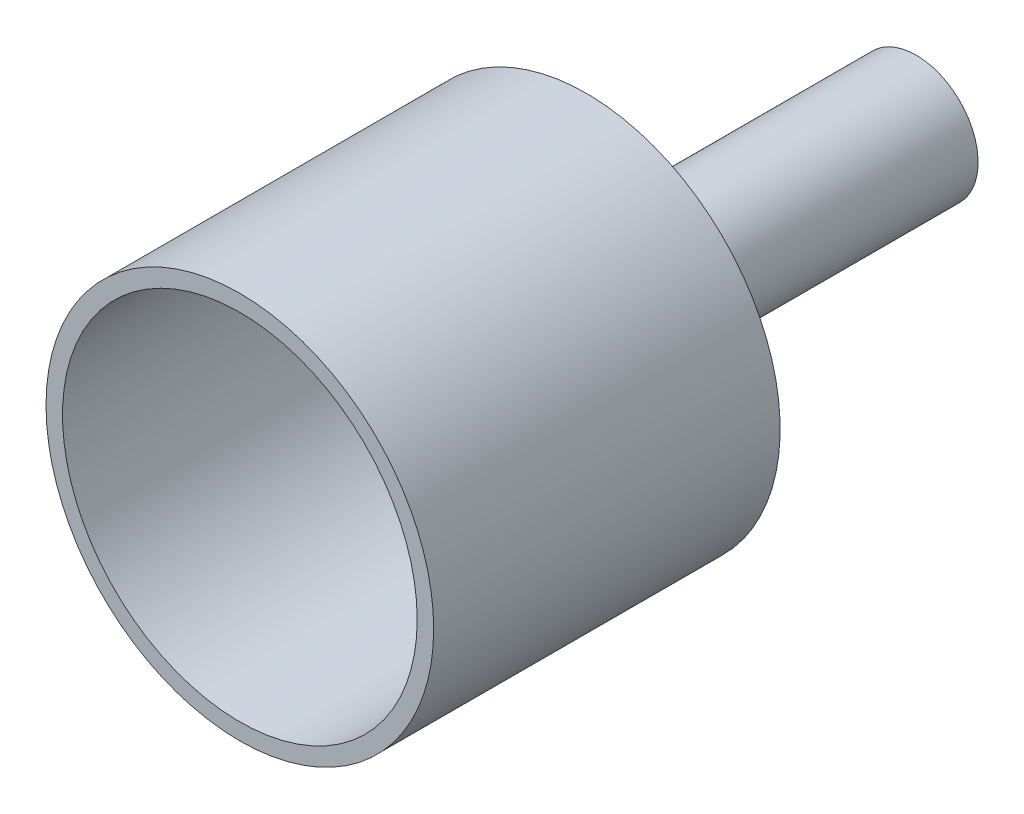
ISO-10303-21;
HEADER;
FILE_DESCRIPTION(('STEP AP214'),'2;1');
FILE_NAME('part.step','',(''),(''),'','','');
FILE_SCHEMA(('AUTOMOTIVE_DESIGN { 1 0 10303 214 1 1 1 1 }'));
ENDSEC;
DATA;
#1=APPLICATION_CONTEXT('core data for automotive mechanical design processes');
#2=APPLICATION_PROTOCOL_DEFINITION('international standard','automotive_design',2000,#1);
#3=PRODUCT_CONTEXT('',#1,'mechanical');
#4=PRODUCT('Part','Part','',(#3));
#5=PRODUCT_RELATED_PRODUCT_CATEGORY('part','',(#4));
#6=PRODUCT_DEFINITION_FORMATION('','',#4);
#7=PRODUCT_DEFINITION_CONTEXT('part definition',#1,'design');
#8=PRODUCT_DEFINITION('design','',#6,#7);
#9=PRODUCT_DEFINITION_SHAPE('','',#8);
#10=(LENGTH_UNIT() NAMED_UNIT(*) SI_UNIT(.MILLI.,.METRE.));
#11=(NAMED_UNIT(*) PLANE_ANGLE_UNIT() SI_UNIT($,.RADIAN.));
#12=(NAMED_UNIT(*) SI_UNIT($,.STERADIAN.) SOLID_ANGLE_UNIT());
#13=UNCERTAINTY_MEASURE_WITH_UNIT(LENGTH_MEASURE(1.E-05),#10,'distance_accuracy_value','');
#14=(GEOMETRIC_REPRESENTATION_CONTEXT(3) GLOBAL_UNCERTAINTY_ASSIGNED_CONTEXT((#13)) GLOBAL_UNIT_ASSIGNED_CONTEXT((#10,
#11,#12)) REPRESENTATION_CONTEXT('',''));
#15=CARTESIAN_POINT('',(0.,0.,0.));
#16=DIRECTION('',(0.,0.,1.));
#17=DIRECTION('',(1.,0.,0.));
#18=AXIS2_PLACEMENT_3D('',#15,#16,#17);
#19=CARTESIAN_POINT('',(0.,0.,40.));
#20=DIRECTION('',(0.,0.,1.));
#21=DIRECTION('',(1.,0.,0.));
#22=AXIS2_PLACEMENT_3D('',#19,#20,#21);
#23=PLANE('',#22);
#24=CARTESIAN_POINT('',(0.,0.,40.));
#25=DIRECTION('',(0.,0.,1.));
#26=DIRECTION('',(1.,0.,0.));
#27=AXIS2_PLACEMENT_3D('',#24,#25,#26);
#28=CIRCLE('',#27,23.5);
#29=CARTESIAN_POINT('',(23.5,0.,40.));
#30=VERTEX_POINT('',#29);
#31=EDGE_CURVE('E10',#30,#30,#28,.T.);
#32=ORIENTED_EDGE('',*,*,#31,.T.);
#33=EDGE_LOOP('',(#32));
#34=FACE_BOUND('',#33,.T.);
#35=CARTESIAN_POINT('',(0.,0.,40.));
#36=DIRECTION('',(0.,0.,1.));
#37=DIRECTION('',(1.,0.,0.));
#38=AXIS2_PLACEMENT_3D('',#35,#36,#37);
#39=CIRCLE('',#38,21.5);
#40=CARTESIAN_POINT('',(21.5,0.,40.));
#41=VERTEX_POINT('',#40);
#42=EDGE_CURVE('E45',#41,#41,#39,.T.);
#43=ORIENTED_EDGE('',*,*,#42,.F.);
#44=EDGE_LOOP('',(#43));
#45=FACE_BOUND('',#44,.T.);
#46=ADVANCED_FACE('F37',(#34,#45),#23,.T.);
#47=CARTESIAN_POINT('',(0.,0.,40.));
#48=DIRECTION('',(0.,0.,-1.));
#49=DIRECTION('',(-1.,0.,0.));
#50=AXIS2_PLACEMENT_3D('',#47,#48,#49);
#51=CYLINDRICAL_SURFACE('',#50,23.5);
#52=ORIENTED_EDGE('',*,*,#31,.F.);
#53=EDGE_LOOP('',(#52));
#54=FACE_BOUND('',#53,.T.);
#55=CARTESIAN_POINT('',(0.,0.,-2.));
#56=DIRECTION('',(0.,0.,-1.));
#57=DIRECTION('',(-1.,0.,0.));
#58=AXIS2_PLACEMENT_3D('',#55,#56,#57);
#59=CIRCLE('',#58,23.5);
#60=CARTESIAN_POINT('',(-23.5,0.,-2.));
#61=VERTEX_POINT('',#60);
#62=EDGE_CURVE('E56',#61,#61,#59,.T.);
#63=ORIENTED_EDGE('',*,*,#62,.F.);
#64=EDGE_LOOP('',(#63));
#65=FACE_BOUND('',#64,.T.);
#66=ADVANCED_FACE('F39',(#54,#65),#51,.T.);
#67=CARTESIAN_POINT('',(0.,0.,40.));
#68=DIRECTION('',(0.,0.,-1.));
#69=DIRECTION('',(-1.,0.,0.));
#70=AXIS2_PLACEMENT_3D('',#67,#68,#69);
#71=CYLINDRICAL_SURFACE('',#70,21.5);
#72=ORIENTED_EDGE('',*,*,#42,.T.);
#73=EDGE_LOOP('',(#72));
#74=FACE_BOUND('',#73,.T.);
#75=CARTESIAN_POINT('',(0.,0.,0.));
#76=DIRECTION('',(0.,0.,1.));
#77=DIRECTION('',(1.,0.,0.));
#78=AXIS2_PLACEMENT_3D('',#75,#76,#77);
#79=CIRCLE('',#78,21.5);
#80=CARTESIAN_POINT('',(21.5,0.,0.));
#81=VERTEX_POINT('',#80);
#82=EDGE_CURVE('E50',#81,#81,#79,.T.);
#83=ORIENTED_EDGE('',*,*,#82,.F.);
#84=EDGE_LOOP('',(#83));
#85=FACE_BOUND('',#84,.T.);
#86=ADVANCED_FACE('F97',(#74,#85),#71,.F.);
#87=CARTESIAN_POINT('',(0.,0.,0.));
#88=DIRECTION('',(0.,0.,-1.));
#89=DIRECTION('',(-1.,0.,0.));
#90=AXIS2_PLACEMENT_3D('',#87,#88,#89);
#91=PLANE('',#90);
#92=CARTESIAN_POINT('',(0.,0.,0.));
#93=DIRECTION('',(0.,0.,-1.));
#94=DIRECTION('',(-1.,0.,0.));
#95=AXIS2_PLACEMENT_3D('',#92,#93,#94);
#96=CIRCLE('',#95,5.5);
#97=CARTESIAN_POINT('',(-5.5,0.,0.));
#98=VERTEX_POINT('',#97);
#99=EDGE_CURVE('E73',#98,#98,#96,.T.);
#100=ORIENTED_EDGE('',*,*,#99,.T.);
#101=EDGE_LOOP('',(#100));
#102=FACE_BOUND('',#101,.T.);
#103=ORIENTED_EDGE('',*,*,#82,.T.);
#104=EDGE_LOOP('',(#103));
#105=FACE_BOUND('',#104,.T.);
#106=ADVANCED_FACE('F78',(#102,#105),#91,.F.);
#107=CARTESIAN_POINT('',(0.,0.,-2.));
#108=DIRECTION('',(0.,0.,-1.));
#109=DIRECTION('',(-1.,0.,0.));
#110=AXIS2_PLACEMENT_3D('',#107,#108,#109);
#111=PLANE('',#110);
#112=CARTESIAN_POINT('',(0.,0.,-2.));
#113=DIRECTION('',(0.,0.,-1.));
#114=DIRECTION('',(-1.,0.,0.));
#115=AXIS2_PLACEMENT_3D('',#112,#113,#114);
#116=CIRCLE('',#115,7.5);
#117=CARTESIAN_POINT('',(-7.5,0.,-2.));
#118=VERTEX_POINT('',#117);
#119=EDGE_CURVE('E62',#118,#118,#116,.T.);
#120=ORIENTED_EDGE('',*,*,#119,.F.);
#121=EDGE_LOOP('',(#120));
#122=FACE_BOUND('',#121,.T.);
#123=ORIENTED_EDGE('',*,*,#62,.T.);
#124=EDGE_LOOP('',(#123));
#125=FACE_BOUND('',#124,.T.);
#126=ADVANCED_FACE('F105',(#122,#125),#111,.T.);
#127=CARTESIAN_POINT('',(0.,0.,-42.));
#128=DIRECTION('',(0.,0.,-1.));
#129=DIRECTION('',(-1.,0.,0.));
#130=AXIS2_PLACEMENT_3D('',#127,#128,#129);
#131=PLANE('',#130);
#132=CARTESIAN_POINT('',(0.,0.,-42.));
#133=DIRECTION('',(0.,0.,-1.));
#134=DIRECTION('',(-1.,0.,0.));
#135=AXIS2_PLACEMENT_3D('',#132,#133,#134);
#136=CIRCLE('',#135,7.5);
#137=CARTESIAN_POINT('',(-7.5,0.,-42.));
#138=VERTEX_POINT('',#137);
#139=EDGE_CURVE('E61',#138,#138,#136,.T.);
#140=ORIENTED_EDGE('',*,*,#139,.T.);
#141=EDGE_LOOP('',(#140));
#142=FACE_BOUND('',#141,.T.);
#143=CARTESIAN_POINT('',(0.,0.,-42.));
#144=DIRECTION('',(0.,0.,-1.));
#145=DIRECTION('',(-1.,0.,0.));
#146=AXIS2_PLACEMENT_3D('',#143,#144,#145);
#147=CIRCLE('',#146,5.5);
#148=CARTESIAN_POINT('',(-5.5,0.,-42.));
#149=VERTEX_POINT('',#148);
#150=EDGE_CURVE('E66',#149,#149,#147,.T.);
#151=ORIENTED_EDGE('',*,*,#150,.F.);
#152=EDGE_LOOP('',(#151));
#153=FACE_BOUND('',#152,.T.);
#154=ADVANCED_FACE('F89',(#142,#153),#131,.T.);
#155=CARTESIAN_POINT('',(0.,0.,-42.));
#156=DIRECTION('',(0.,0.,1.));
#157=DIRECTION('',(1.,0.,0.));
#158=AXIS2_PLACEMENT_3D('',#155,#156,#157);
#159=CYLINDRICAL_SURFACE('',#158,7.5);
#160=ORIENTED_EDGE('',*,*,#139,.F.);
#161=EDGE_LOOP('',(#160));
#162=FACE_BOUND('',#161,.T.);
#163=ORIENTED_EDGE('',*,*,#119,.T.);
#164=EDGE_LOOP('',(#163));
#165=FACE_BOUND('',#164,.T.);
#166=ADVANCED_FACE('F83',(#162,#165),#159,.T.);
#167=CARTESIAN_POINT('',(0.,0.,-42.));
#168=DIRECTION('',(0.,0.,1.));
#169=DIRECTION('',(1.,0.,0.));
#170=AXIS2_PLACEMENT_3D('',#167,#168,#169);
#171=CYLINDRICAL_SURFACE('',#170,5.5);
#172=ORIENTED_EDGE('',*,*,#150,.T.);
#173=EDGE_LOOP('',(#172));
#174=FACE_BOUND('',#173,.T.);
#175=ORIENTED_EDGE('',*,*,#99,.F.);
#176=EDGE_LOOP('',(#175));
#177=FACE_BOUND('',#176,.T.);
#178=ADVANCED_FACE('F81',(#174,#177),#171,.F.);
#179=CLOSED_SHELL('',(#46,#66,#86,#106,#126,#154,#166,#178));
#180=MANIFOLD_SOLID_BREP('B2',#179);
#181=ADVANCED_BREP_SHAPE_REPRESENTATION('',(#18,#180),#14);
#182=SHAPE_DEFINITION_REPRESENTATION(#9,#181);
ENDSEC;
END-ISO-10303-21;
